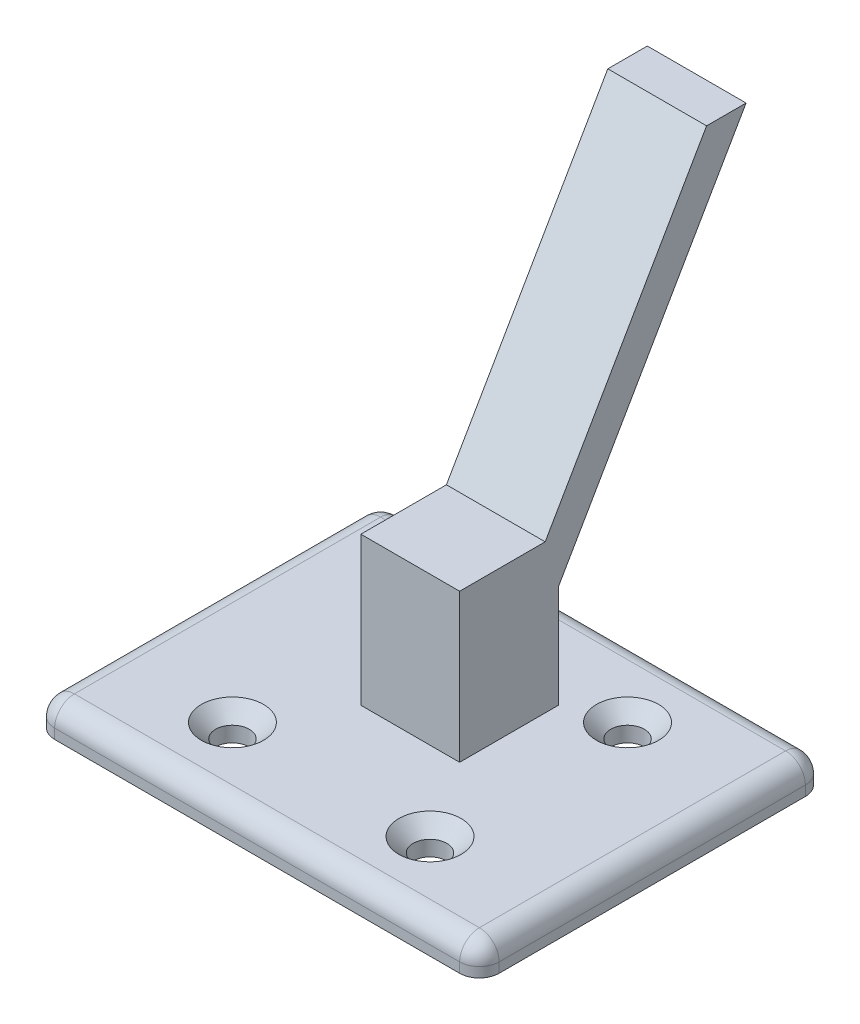
ISO-10303-21;
HEADER;
FILE_DESCRIPTION(('STEP AP214'),'2;1');
FILE_NAME('part.step','',(''),(''),'','','');
FILE_SCHEMA(('AUTOMOTIVE_DESIGN { 1 0 10303 214 1 1 1 1 }'));
ENDSEC;
DATA;
#1=APPLICATION_CONTEXT('core data for automotive mechanical design processes');
#2=APPLICATION_PROTOCOL_DEFINITION('international standard','automotive_design',2000,#1);
#3=PRODUCT_CONTEXT('',#1,'mechanical');
#4=PRODUCT('Part','Part','',(#3));
#5=PRODUCT_RELATED_PRODUCT_CATEGORY('part','',(#4));
#6=PRODUCT_DEFINITION_FORMATION('','',#4);
#7=PRODUCT_DEFINITION_CONTEXT('part definition',#1,'design');
#8=PRODUCT_DEFINITION('design','',#6,#7);
#9=PRODUCT_DEFINITION_SHAPE('','',#8);
#10=(LENGTH_UNIT() NAMED_UNIT(*) SI_UNIT(.MILLI.,.METRE.));
#11=(NAMED_UNIT(*) PLANE_ANGLE_UNIT() SI_UNIT($,.RADIAN.));
#12=(NAMED_UNIT(*) SI_UNIT($,.STERADIAN.) SOLID_ANGLE_UNIT());
#13=UNCERTAINTY_MEASURE_WITH_UNIT(LENGTH_MEASURE(1.E-05),#10,'distance_accuracy_value','');
#14=(GEOMETRIC_REPRESENTATION_CONTEXT(3) GLOBAL_UNCERTAINTY_ASSIGNED_CONTEXT((#13)) GLOBAL_UNIT_ASSIGNED_CONTEXT((#10,
#11,#12)) REPRESENTATION_CONTEXT('',''));
#15=CARTESIAN_POINT('',(0.,0.,0.));
#16=DIRECTION('',(0.,0.,1.));
#17=DIRECTION('',(1.,0.,0.));
#18=AXIS2_PLACEMENT_3D('',#15,#16,#17);
#19=CARTESIAN_POINT('',(0.,3.,0.));
#20=DIRECTION('',(0.,-1.,0.));
#21=DIRECTION('',(0.,0.,-1.));
#22=AXIS2_PLACEMENT_3D('',#19,#20,#21);
#23=PLANE('',#22);
#24=CARTESIAN_POINT('',(10.,3.,10.));
#25=DIRECTION('',(0.,1.,0.));
#26=DIRECTION('',(0.,0.,1.));
#27=AXIS2_PLACEMENT_3D('',#24,#25,#26);
#28=CIRCLE('',#27,3.15);
#29=CARTESIAN_POINT('',(10.,3.,13.15));
#30=VERTEX_POINT('',#29);
#31=EDGE_CURVE('E235',#30,#30,#28,.T.);
#32=ORIENTED_EDGE('',*,*,#31,.F.);
#33=EDGE_LOOP('',(#32));
#34=FACE_BOUND('',#33,.T.);
#35=CARTESIAN_POINT('',(-9.99999999999999,3.,10.));
#36=DIRECTION('',(0.,1.,0.));
#37=DIRECTION('',(0.,0.,1.));
#38=AXIS2_PLACEMENT_3D('',#35,#36,#37);
#39=CIRCLE('',#38,3.15);
#40=CARTESIAN_POINT('',(-9.99999999999999,3.,13.15));
#41=VERTEX_POINT('',#40);
#42=EDGE_CURVE('E226',#41,#41,#39,.T.);
#43=ORIENTED_EDGE('',*,*,#42,.F.);
#44=EDGE_LOOP('',(#43));
#45=FACE_BOUND('',#44,.T.);
#46=CARTESIAN_POINT('',(-10.,3.,-10.));
#47=DIRECTION('',(0.,1.,0.));
#48=DIRECTION('',(0.,0.,1.));
#49=AXIS2_PLACEMENT_3D('',#46,#47,#48);
#50=CIRCLE('',#49,3.15);
#51=CARTESIAN_POINT('',(-10.,3.,-6.85));
#52=VERTEX_POINT('',#51);
#53=EDGE_CURVE('E217',#52,#52,#50,.T.);
#54=ORIENTED_EDGE('',*,*,#53,.F.);
#55=EDGE_LOOP('',(#54));
#56=FACE_BOUND('',#55,.T.);
#57=CARTESIAN_POINT('',(9.99999999999998,3.,-10.));
#58=DIRECTION('',(0.,1.,0.));
#59=DIRECTION('',(0.,0.,1.));
#60=AXIS2_PLACEMENT_3D('',#57,#58,#59);
#61=CIRCLE('',#60,3.15);
#62=CARTESIAN_POINT('',(9.99999999999998,3.,-6.85000000000002));
#63=VERTEX_POINT('',#62);
#64=EDGE_CURVE('E208',#63,#63,#61,.T.);
#65=ORIENTED_EDGE('',*,*,#64,.F.);
#66=EDGE_LOOP('',(#65));
#67=FACE_BOUND('',#66,.T.);
#68=DIRECTION('',(-1.,0.,0.));
#69=VECTOR('',#68,1.);
#70=CARTESIAN_POINT('',(0.,3.,-15.5));
#71=LINE('',#70,#69);
#72=CARTESIAN_POINT('',(20.5,3.,-15.5));
#73=VERTEX_POINT('',#72);
#74=CARTESIAN_POINT('',(-20.5,3.,-15.5));
#75=VERTEX_POINT('',#74);
#76=EDGE_CURVE('E293',#73,#75,#71,.T.);
#77=ORIENTED_EDGE('',*,*,#76,.T.);
#78=DIRECTION('',(0.,0.,1.));
#79=VECTOR('',#78,1.);
#80=CARTESIAN_POINT('',(-20.5,3.,0.));
#81=LINE('',#80,#79);
#82=CARTESIAN_POINT('',(-20.5,3.,15.5));
#83=VERTEX_POINT('',#82);
#84=EDGE_CURVE('E43',#75,#83,#81,.T.);
#85=ORIENTED_EDGE('',*,*,#84,.T.);
#86=DIRECTION('',(1.,0.,0.));
#87=VECTOR('',#86,1.);
#88=CARTESIAN_POINT('',(0.,3.,15.5));
#89=LINE('',#88,#87);
#90=CARTESIAN_POINT('',(20.5,3.,15.5));
#91=VERTEX_POINT('',#90);
#92=EDGE_CURVE('E289',#83,#91,#89,.T.);
#93=ORIENTED_EDGE('',*,*,#92,.T.);
#94=DIRECTION('',(0.,0.,-1.));
#95=VECTOR('',#94,1.);
#96=CARTESIAN_POINT('',(20.5,3.,0.));
#97=LINE('',#96,#95);
#98=EDGE_CURVE('E291',#91,#73,#97,.T.);
#99=ORIENTED_EDGE('',*,*,#98,.T.);
#100=EDGE_LOOP('',(#77,#85,#93,#99));
#101=FACE_BOUND('',#100,.T.);
#102=DIRECTION('',(0.,0.,1.));
#103=VECTOR('',#102,1.);
#104=CARTESIAN_POINT('',(-5.,3.,2.));
#105=LINE('',#104,#103);
#106=CARTESIAN_POINT('',(-5.,3.,-8.00000000000001));
#107=VERTEX_POINT('',#106);
#108=CARTESIAN_POINT('',(-5.,3.,2.));
#109=VERTEX_POINT('',#108);
#110=EDGE_CURVE('E50',#107,#109,#105,.T.);
#111=ORIENTED_EDGE('',*,*,#110,.F.);
#112=DIRECTION('',(-1.,0.,0.));
#113=VECTOR('',#112,1.);
#114=CARTESIAN_POINT('',(-5.,3.,-8.00000000000001));
#115=LINE('',#114,#113);
#116=CARTESIAN_POINT('',(5.,3.,-8.00000000000001));
#117=VERTEX_POINT('',#116);
#118=EDGE_CURVE('E163',#117,#107,#115,.T.);
#119=ORIENTED_EDGE('',*,*,#118,.F.);
#120=DIRECTION('',(0.,0.,-1.));
#121=VECTOR('',#120,1.);
#122=CARTESIAN_POINT('',(5.,3.,2.));
#123=LINE('',#122,#121);
#124=CARTESIAN_POINT('',(5.,3.,1.99999999999999));
#125=VERTEX_POINT('',#124);
#126=EDGE_CURVE('E58',#125,#117,#123,.T.);
#127=ORIENTED_EDGE('',*,*,#126,.F.);
#128=DIRECTION('',(1.,0.,0.));
#129=VECTOR('',#128,1.);
#130=CARTESIAN_POINT('',(-5.,3.,2.));
#131=LINE('',#130,#129);
#132=EDGE_CURVE('E189',#109,#125,#131,.T.);
#133=ORIENTED_EDGE('',*,*,#132,.F.);
#134=EDGE_LOOP('',(#111,#119,#127,#133));
#135=FACE_BOUND('',#134,.T.);
#136=ADVANCED_FACE('F35',(#34,#45,#56,#67,#101,#135),#23,.F.);
#137=CARTESIAN_POINT('',(-5.,46.3012701892218,-27.0000000000002));
#138=DIRECTION('',(0.,0.500000000000004,0.866025403784436));
#139=DIRECTION('',(0.,-0.866025403784436,0.500000000000004));
#140=AXIS2_PLACEMENT_3D('',#137,#138,#139);
#141=PLANE('',#140);
#142=DIRECTION('',(1.,0.,0.));
#143=VECTOR('',#142,1.);
#144=CARTESIAN_POINT('',(-4.99999999999999,13.3923048454132,-8.00000000000001));
#145=LINE('',#144,#143);
#146=CARTESIAN_POINT('',(-5.,13.3923048454132,-8.));
#147=VERTEX_POINT('',#146);
#148=CARTESIAN_POINT('',(5.,13.3923048454132,-8.00000000000001));
#149=VERTEX_POINT('',#148);
#150=EDGE_CURVE('E176',#147,#149,#145,.T.);
#151=ORIENTED_EDGE('',*,*,#150,.F.);
#152=DIRECTION('',(0.,-0.866025403784436,0.500000000000004));
#153=VECTOR('',#152,1.);
#154=CARTESIAN_POINT('',(-5.,46.3012701892218,-27.0000000000002));
#155=LINE('',#154,#153);
#156=CARTESIAN_POINT('',(-5.,46.3012701892218,-27.0000000000002));
#157=VERTEX_POINT('',#156);
#158=EDGE_CURVE('E204',#157,#147,#155,.T.);
#159=ORIENTED_EDGE('',*,*,#158,.F.);
#160=DIRECTION('',(-1.,0.,0.));
#161=VECTOR('',#160,1.);
#162=CARTESIAN_POINT('',(-5.,46.3012701892218,-27.0000000000002));
#163=LINE('',#162,#161);
#164=CARTESIAN_POINT('',(5.,46.3012701892218,-27.0000000000002));
#165=VERTEX_POINT('',#164);
#166=EDGE_CURVE('E188',#165,#157,#163,.T.);
#167=ORIENTED_EDGE('',*,*,#166,.F.);
#168=DIRECTION('',(0.,-0.866025403784436,0.500000000000004));
#169=VECTOR('',#168,1.);
#170=CARTESIAN_POINT('',(5.,46.3012701892218,-27.0000000000002));
#171=LINE('',#170,#169);
#172=EDGE_CURVE('E206',#165,#149,#171,.T.);
#173=ORIENTED_EDGE('',*,*,#172,.T.);
#174=EDGE_LOOP('',(#151,#159,#167,#173));
#175=FACE_BOUND('',#174,.T.);
#176=ADVANCED_FACE('F402',(#175),#141,.F.);
#177=CARTESIAN_POINT('',(-5.,46.3012701892218,-23.0000000000002));
#178=DIRECTION('',(0.,-0.500000000000004,-0.866025403784436));
#179=DIRECTION('',(0.,0.866025403784436,-0.500000000000004));
#180=AXIS2_PLACEMENT_3D('',#177,#178,#179);
#181=PLANE('',#180);
#182=DIRECTION('',(-1.,0.,0.));
#183=VECTOR('',#182,1.);
#184=CARTESIAN_POINT('',(-5.,18.,-6.66025403784447));
#185=LINE('',#184,#183);
#186=CARTESIAN_POINT('',(5.,18.,-6.66025403784448));
#187=VERTEX_POINT('',#186);
#188=CARTESIAN_POINT('',(-5.,18.,-6.66025403784448));
#189=VERTEX_POINT('',#188);
#190=EDGE_CURVE('E11',#187,#189,#185,.T.);
#191=ORIENTED_EDGE('',*,*,#190,.F.);
#192=DIRECTION('',(0.,-0.866025403784436,0.500000000000004));
#193=VECTOR('',#192,1.);
#194=CARTESIAN_POINT('',(5.,46.3012701892218,-23.0000000000002));
#195=LINE('',#194,#193);
#196=CARTESIAN_POINT('',(5.,46.3012701892218,-23.0000000000002));
#197=VERTEX_POINT('',#196);
#198=EDGE_CURVE('E195',#197,#187,#195,.T.);
#199=ORIENTED_EDGE('',*,*,#198,.F.);
#200=DIRECTION('',(1.,0.,0.));
#201=VECTOR('',#200,1.);
#202=CARTESIAN_POINT('',(-5.,46.3012701892218,-23.0000000000002));
#203=LINE('',#202,#201);
#204=CARTESIAN_POINT('',(-5.,46.3012701892218,-23.0000000000002));
#205=VERTEX_POINT('',#204);
#206=EDGE_CURVE('E193',#205,#197,#203,.T.);
#207=ORIENTED_EDGE('',*,*,#206,.F.);
#208=DIRECTION('',(0.,-0.866025403784436,0.500000000000004));
#209=VECTOR('',#208,1.);
#210=CARTESIAN_POINT('',(-5.,46.3012701892218,-23.0000000000002));
#211=LINE('',#210,#209);
#212=EDGE_CURVE('E202',#205,#189,#211,.T.);
#213=ORIENTED_EDGE('',*,*,#212,.T.);
#214=EDGE_LOOP('',(#191,#199,#207,#213));
#215=FACE_BOUND('',#214,.T.);
#216=ADVANCED_FACE('F408',(#215),#181,.F.);
#217=CARTESIAN_POINT('',(-22.5,3.,-17.5));
#218=DIRECTION('',(1.,0.,0.));
#219=DIRECTION('',(0.,0.,-1.));
#220=AXIS2_PLACEMENT_3D('',#217,#218,#219);
#221=PLANE('',#220);
#222=DIRECTION('',(0.,0.,1.));
#223=VECTOR('',#222,1.);
#224=CARTESIAN_POINT('',(-22.5,1.,-17.5));
#225=LINE('',#224,#223);
#226=CARTESIAN_POINT('',(-22.5,1.,15.5));
#227=VERTEX_POINT('',#226);
#228=CARTESIAN_POINT('',(-22.5,1.,-15.5));
#229=VERTEX_POINT('',#228);
#230=EDGE_CURVE('E256',#227,#229,#225,.F.);
#231=ORIENTED_EDGE('',*,*,#230,.T.);
#232=DIRECTION('',(0.,-1.,0.));
#233=VECTOR('',#232,1.);
#234=CARTESIAN_POINT('',(-22.5,3.,-15.5));
#235=LINE('',#234,#233);
#236=CARTESIAN_POINT('',(-22.5,0.,-15.5));
#237=VERTEX_POINT('',#236);
#238=EDGE_CURVE('E260',#229,#237,#235,.T.);
#239=ORIENTED_EDGE('',*,*,#238,.T.);
#240=DIRECTION('',(0.,0.,1.));
#241=VECTOR('',#240,1.);
#242=CARTESIAN_POINT('',(-22.5,0.,-17.5));
#243=LINE('',#242,#241);
#244=CARTESIAN_POINT('',(-22.5,0.,15.5));
#245=VERTEX_POINT('',#244);
#246=EDGE_CURVE('E244',#237,#245,#243,.T.);
#247=ORIENTED_EDGE('',*,*,#246,.T.);
#248=DIRECTION('',(0.,-1.,0.));
#249=VECTOR('',#248,1.);
#250=CARTESIAN_POINT('',(-22.5,3.,15.5));
#251=LINE('',#250,#249);
#252=EDGE_CURVE('E258',#245,#227,#251,.F.);
#253=ORIENTED_EDGE('',*,*,#252,.T.);
#254=EDGE_LOOP('',(#231,#239,#247,#253));
#255=FACE_BOUND('',#254,.T.);
#256=ADVANCED_FACE('F365',(#255),#221,.F.);
#257=CARTESIAN_POINT('',(22.5,3.,17.5));
#258=DIRECTION('',(0.,0.,-1.));
#259=DIRECTION('',(-1.,0.,0.));
#260=AXIS2_PLACEMENT_3D('',#257,#258,#259);
#261=PLANE('',#260);
#262=DIRECTION('',(1.,0.,0.));
#263=VECTOR('',#262,1.);
#264=CARTESIAN_POINT('',(22.5,1.,17.5));
#265=LINE('',#264,#263);
#266=CARTESIAN_POINT('',(20.5,1.,17.5));
#267=VERTEX_POINT('',#266);
#268=CARTESIAN_POINT('',(-20.5,1.,17.5));
#269=VERTEX_POINT('',#268);
#270=EDGE_CURVE('E283',#267,#269,#265,.F.);
#271=ORIENTED_EDGE('',*,*,#270,.T.);
#272=DIRECTION('',(0.,-1.,0.));
#273=VECTOR('',#272,1.);
#274=CARTESIAN_POINT('',(-20.5,3.,17.5));
#275=LINE('',#274,#273);
#276=CARTESIAN_POINT('',(-20.5,0.,17.5));
#277=VERTEX_POINT('',#276);
#278=EDGE_CURVE('E287',#269,#277,#275,.T.);
#279=ORIENTED_EDGE('',*,*,#278,.T.);
#280=DIRECTION('',(1.,0.,0.));
#281=VECTOR('',#280,1.);
#282=CARTESIAN_POINT('',(22.5,0.,17.5));
#283=LINE('',#282,#281);
#284=CARTESIAN_POINT('',(20.5,0.,17.5));
#285=VERTEX_POINT('',#284);
#286=EDGE_CURVE('E247',#277,#285,#283,.T.);
#287=ORIENTED_EDGE('',*,*,#286,.T.);
#288=DIRECTION('',(0.,-1.,0.));
#289=VECTOR('',#288,1.);
#290=CARTESIAN_POINT('',(20.5,3.,17.5));
#291=LINE('',#290,#289);
#292=EDGE_CURVE('E285',#285,#267,#291,.F.);
#293=ORIENTED_EDGE('',*,*,#292,.T.);
#294=EDGE_LOOP('',(#271,#279,#287,#293));
#295=FACE_BOUND('',#294,.T.);
#296=ADVANCED_FACE('F353',(#295),#261,.F.);
#297=CARTESIAN_POINT('',(22.5,3.,-17.5));
#298=DIRECTION('',(-1.,0.,0.));
#299=DIRECTION('',(0.,0.,1.));
#300=AXIS2_PLACEMENT_3D('',#297,#298,#299);
#301=PLANE('',#300);
#302=DIRECTION('',(0.,0.,-1.));
#303=VECTOR('',#302,1.);
#304=CARTESIAN_POINT('',(22.5,0.,-17.5));
#305=LINE('',#304,#303);
#306=CARTESIAN_POINT('',(22.5,0.,15.5));
#307=VERTEX_POINT('',#306);
#308=CARTESIAN_POINT('',(22.5,0.,-15.5));
#309=VERTEX_POINT('',#308);
#310=EDGE_CURVE('E250',#307,#309,#305,.T.);
#311=ORIENTED_EDGE('',*,*,#310,.T.);
#312=DIRECTION('',(0.,-1.,0.));
#313=VECTOR('',#312,1.);
#314=CARTESIAN_POINT('',(22.5,3.,-15.5));
#315=LINE('',#314,#313);
#316=CARTESIAN_POINT('',(22.5,1.,-15.5));
#317=VERTEX_POINT('',#316);
#318=EDGE_CURVE('E281',#309,#317,#315,.F.);
#319=ORIENTED_EDGE('',*,*,#318,.T.);
#320=DIRECTION('',(0.,0.,-1.));
#321=VECTOR('',#320,1.);
#322=CARTESIAN_POINT('',(22.5,1.,-17.5));
#323=LINE('',#322,#321);
#324=CARTESIAN_POINT('',(22.5,1.,15.5));
#325=VERTEX_POINT('',#324);
#326=EDGE_CURVE('E277',#317,#325,#323,.F.);
#327=ORIENTED_EDGE('',*,*,#326,.T.);
#328=DIRECTION('',(0.,-1.,0.));
#329=VECTOR('',#328,1.);
#330=CARTESIAN_POINT('',(22.5,3.,15.5));
#331=LINE('',#330,#329);
#332=EDGE_CURVE('E279',#325,#307,#331,.T.);
#333=ORIENTED_EDGE('',*,*,#332,.T.);
#334=EDGE_LOOP('',(#311,#319,#327,#333));
#335=FACE_BOUND('',#334,.T.);
#336=ADVANCED_FACE('F422',(#335),#301,.F.);
#337=CARTESIAN_POINT('',(22.5,3.,-17.5));
#338=DIRECTION('',(0.,0.,1.));
#339=DIRECTION('',(1.,0.,0.));
#340=AXIS2_PLACEMENT_3D('',#337,#338,#339);
#341=PLANE('',#340);
#342=DIRECTION('',(-1.,0.,0.));
#343=VECTOR('',#342,1.);
#344=CARTESIAN_POINT('',(22.5,0.,-17.5));
#345=LINE('',#344,#343);
#346=CARTESIAN_POINT('',(20.5,0.,-17.5));
#347=VERTEX_POINT('',#346);
#348=CARTESIAN_POINT('',(-20.5,0.,-17.5));
#349=VERTEX_POINT('',#348);
#350=EDGE_CURVE('E253',#347,#349,#345,.T.);
#351=ORIENTED_EDGE('',*,*,#350,.T.);
#352=DIRECTION('',(0.,-1.,0.));
#353=VECTOR('',#352,1.);
#354=CARTESIAN_POINT('',(-20.5,3.,-17.5));
#355=LINE('',#354,#353);
#356=CARTESIAN_POINT('',(-20.5,1.,-17.5));
#357=VERTEX_POINT('',#356);
#358=EDGE_CURVE('E275',#349,#357,#355,.F.);
#359=ORIENTED_EDGE('',*,*,#358,.T.);
#360=DIRECTION('',(-1.,0.,0.));
#361=VECTOR('',#360,1.);
#362=CARTESIAN_POINT('',(22.5,1.,-17.5));
#363=LINE('',#362,#361);
#364=CARTESIAN_POINT('',(20.5,1.,-17.5));
#365=VERTEX_POINT('',#364);
#366=EDGE_CURVE('E271',#357,#365,#363,.F.);
#367=ORIENTED_EDGE('',*,*,#366,.T.);
#368=DIRECTION('',(0.,-1.,0.));
#369=VECTOR('',#368,1.);
#370=CARTESIAN_POINT('',(20.5,3.,-17.5));
#371=LINE('',#370,#369);
#372=EDGE_CURVE('E273',#365,#347,#371,.T.);
#373=ORIENTED_EDGE('',*,*,#372,.T.);
#374=EDGE_LOOP('',(#351,#359,#367,#373));
#375=FACE_BOUND('',#374,.T.);
#376=ADVANCED_FACE('F376',(#375),#341,.F.);
#377=CARTESIAN_POINT('',(0.,0.,0.));
#378=DIRECTION('',(0.,-1.,0.));
#379=DIRECTION('',(0.,0.,-1.));
#380=AXIS2_PLACEMENT_3D('',#377,#378,#379);
#381=PLANE('',#380);
#382=CARTESIAN_POINT('',(9.99999999999998,0.,-10.));
#383=DIRECTION('',(0.,-1.,0.));
#384=DIRECTION('',(0.,0.,-1.));
#385=AXIS2_PLACEMENT_3D('',#382,#383,#384);
#386=CIRCLE('',#385,1.69999999999999);
#387=CARTESIAN_POINT('',(9.99999999999998,0.,-11.7));
#388=VERTEX_POINT('',#387);
#389=EDGE_CURVE('E214',#388,#388,#386,.T.);
#390=ORIENTED_EDGE('',*,*,#389,.F.);
#391=EDGE_LOOP('',(#390));
#392=FACE_BOUND('',#391,.T.);
#393=CARTESIAN_POINT('',(-10.,0.,-10.));
#394=DIRECTION('',(0.,-1.,0.));
#395=DIRECTION('',(0.,0.,-1.));
#396=AXIS2_PLACEMENT_3D('',#393,#394,#395);
#397=CIRCLE('',#396,1.69999999999999);
#398=CARTESIAN_POINT('',(-10.,0.,-11.7));
#399=VERTEX_POINT('',#398);
#400=EDGE_CURVE('E223',#399,#399,#397,.T.);
#401=ORIENTED_EDGE('',*,*,#400,.F.);
#402=EDGE_LOOP('',(#401));
#403=FACE_BOUND('',#402,.T.);
#404=CARTESIAN_POINT('',(-9.99999999999999,0.,10.));
#405=DIRECTION('',(0.,-1.,0.));
#406=DIRECTION('',(0.,0.,-1.));
#407=AXIS2_PLACEMENT_3D('',#404,#405,#406);
#408=CIRCLE('',#407,1.69999999999999);
#409=CARTESIAN_POINT('',(-9.99999999999999,0.,8.30000000000001));
#410=VERTEX_POINT('',#409);
#411=EDGE_CURVE('E232',#410,#410,#408,.T.);
#412=ORIENTED_EDGE('',*,*,#411,.F.);
#413=EDGE_LOOP('',(#412));
#414=FACE_BOUND('',#413,.T.);
#415=CARTESIAN_POINT('',(10.,0.,10.));
#416=DIRECTION('',(0.,-1.,0.));
#417=DIRECTION('',(0.,0.,-1.));
#418=AXIS2_PLACEMENT_3D('',#415,#416,#417);
#419=CIRCLE('',#418,1.69999999999999);
#420=CARTESIAN_POINT('',(10.,0.,8.30000000000002));
#421=VERTEX_POINT('',#420);
#422=EDGE_CURVE('E241',#421,#421,#419,.T.);
#423=ORIENTED_EDGE('',*,*,#422,.F.);
#424=EDGE_LOOP('',(#423));
#425=FACE_BOUND('',#424,.T.);
#426=ORIENTED_EDGE('',*,*,#246,.F.);
#427=CARTESIAN_POINT('',(-20.5,0.,-15.5));
#428=DIRECTION('',(0.,-1.,0.));
#429=DIRECTION('',(0.,0.,-1.));
#430=AXIS2_PLACEMENT_3D('',#427,#428,#429);
#431=CIRCLE('',#430,2.);
#432=EDGE_CURVE('E269',#237,#349,#431,.T.);
#433=ORIENTED_EDGE('',*,*,#432,.T.);
#434=ORIENTED_EDGE('',*,*,#350,.F.);
#435=CARTESIAN_POINT('',(20.5,0.,-15.5));
#436=DIRECTION('',(0.,-1.,0.));
#437=DIRECTION('',(0.,0.,-1.));
#438=AXIS2_PLACEMENT_3D('',#435,#436,#437);
#439=CIRCLE('',#438,2.);
#440=EDGE_CURVE('E267',#347,#309,#439,.T.);
#441=ORIENTED_EDGE('',*,*,#440,.T.);
#442=ORIENTED_EDGE('',*,*,#310,.F.);
#443=CARTESIAN_POINT('',(20.5,0.,15.5));
#444=DIRECTION('',(0.,-1.,0.));
#445=DIRECTION('',(0.,0.,-1.));
#446=AXIS2_PLACEMENT_3D('',#443,#444,#445);
#447=CIRCLE('',#446,2.);
#448=EDGE_CURVE('E263',#307,#285,#447,.T.);
#449=ORIENTED_EDGE('',*,*,#448,.T.);
#450=ORIENTED_EDGE('',*,*,#286,.F.);
#451=CARTESIAN_POINT('',(-20.5,0.,15.5));
#452=DIRECTION('',(0.,-1.,0.));
#453=DIRECTION('',(0.,0.,-1.));
#454=AXIS2_PLACEMENT_3D('',#451,#452,#453);
#455=CIRCLE('',#454,2.);
#456=EDGE_CURVE('E265',#277,#245,#455,.T.);
#457=ORIENTED_EDGE('',*,*,#456,.T.);
#458=EDGE_LOOP('',(#426,#433,#434,#441,#442,#449,#450,#457));
#459=FACE_BOUND('',#458,.T.);
#460=ADVANCED_FACE('F363',(#392,#403,#414,#425,#459),#381,.T.);
#461=CARTESIAN_POINT('',(10.,3.,10.));
#462=DIRECTION('',(0.,1.,0.));
#463=DIRECTION('',(0.,0.,1.));
#464=AXIS2_PLACEMENT_3D('',#461,#462,#463);
#465=CYLINDRICAL_SURFACE('',#464,1.69999999999999);
#466=CARTESIAN_POINT('',(10.,1.54999999999999,10.));
#467=DIRECTION('',(0.,1.,0.));
#468=DIRECTION('',(0.,0.,1.));
#469=AXIS2_PLACEMENT_3D('',#466,#467,#468);
#470=CIRCLE('',#469,1.69999999999999);
#471=CARTESIAN_POINT('',(10.,1.54999999999999,11.7));
#472=VERTEX_POINT('',#471);
#473=EDGE_CURVE('E238',#472,#472,#470,.T.);
#474=ORIENTED_EDGE('',*,*,#473,.T.);
#475=EDGE_LOOP('',(#474));
#476=FACE_BOUND('',#475,.T.);
#477=ORIENTED_EDGE('',*,*,#422,.T.);
#478=EDGE_LOOP('',(#477));
#479=FACE_BOUND('',#478,.T.);
#480=ADVANCED_FACE('F415',(#476,#479),#465,.F.);
#481=CARTESIAN_POINT('',(10.,3.,10.));
#482=DIRECTION('',(0.,1.,0.));
#483=DIRECTION('',(0.,0.,1.));
#484=AXIS2_PLACEMENT_3D('',#481,#482,#483);
#485=CONICAL_SURFACE('',#484,3.15,0.78539816339745);
#486=ORIENTED_EDGE('',*,*,#473,.F.);
#487=EDGE_LOOP('',(#486));
#488=FACE_BOUND('',#487,.T.);
#489=ORIENTED_EDGE('',*,*,#31,.T.);
#490=EDGE_LOOP('',(#489));
#491=FACE_BOUND('',#490,.T.);
#492=ADVANCED_FACE('F623',(#488,#491),#485,.F.);
#493=CARTESIAN_POINT('',(-9.99999999999999,3.,10.));
#494=DIRECTION('',(0.,1.,0.));
#495=DIRECTION('',(0.,0.,1.));
#496=AXIS2_PLACEMENT_3D('',#493,#494,#495);
#497=CYLINDRICAL_SURFACE('',#496,1.69999999999999);
#498=CARTESIAN_POINT('',(-9.99999999999999,1.54999999999999,10.));
#499=DIRECTION('',(0.,1.,0.));
#500=DIRECTION('',(0.,0.,1.));
#501=AXIS2_PLACEMENT_3D('',#498,#499,#500);
#502=CIRCLE('',#501,1.69999999999999);
#503=CARTESIAN_POINT('',(-9.99999999999999,1.54999999999999,11.7));
#504=VERTEX_POINT('',#503);
#505=EDGE_CURVE('E229',#504,#504,#502,.T.);
#506=ORIENTED_EDGE('',*,*,#505,.T.);
#507=EDGE_LOOP('',(#506));
#508=FACE_BOUND('',#507,.T.);
#509=ORIENTED_EDGE('',*,*,#411,.T.);
#510=EDGE_LOOP('',(#509));
#511=FACE_BOUND('',#510,.T.);
#512=ADVANCED_FACE('F629',(#508,#511),#497,.F.);
#513=CARTESIAN_POINT('',(-9.99999999999999,3.,10.));
#514=DIRECTION('',(0.,1.,0.));
#515=DIRECTION('',(0.,0.,1.));
#516=AXIS2_PLACEMENT_3D('',#513,#514,#515);
#517=CONICAL_SURFACE('',#516,3.15,0.78539816339745);
#518=ORIENTED_EDGE('',*,*,#505,.F.);
#519=EDGE_LOOP('',(#518));
#520=FACE_BOUND('',#519,.T.);
#521=ORIENTED_EDGE('',*,*,#42,.T.);
#522=EDGE_LOOP('',(#521));
#523=FACE_BOUND('',#522,.T.);
#524=ADVANCED_FACE('F636',(#520,#523),#517,.F.);
#525=CARTESIAN_POINT('',(-10.,3.,-10.));
#526=DIRECTION('',(0.,1.,0.));
#527=DIRECTION('',(0.,0.,1.));
#528=AXIS2_PLACEMENT_3D('',#525,#526,#527);
#529=CYLINDRICAL_SURFACE('',#528,1.69999999999999);
#530=CARTESIAN_POINT('',(-10.,1.54999999999999,-10.));
#531=DIRECTION('',(0.,1.,0.));
#532=DIRECTION('',(0.,0.,1.));
#533=AXIS2_PLACEMENT_3D('',#530,#531,#532);
#534=CIRCLE('',#533,1.69999999999999);
#535=CARTESIAN_POINT('',(-10.,1.54999999999999,-8.30000000000001));
#536=VERTEX_POINT('',#535);
#537=EDGE_CURVE('E220',#536,#536,#534,.T.);
#538=ORIENTED_EDGE('',*,*,#537,.T.);
#539=EDGE_LOOP('',(#538));
#540=FACE_BOUND('',#539,.T.);
#541=ORIENTED_EDGE('',*,*,#400,.T.);
#542=EDGE_LOOP('',(#541));
#543=FACE_BOUND('',#542,.T.);
#544=ADVANCED_FACE('F644',(#540,#543),#529,.F.);
#545=CARTESIAN_POINT('',(-10.,3.,-10.));
#546=DIRECTION('',(0.,1.,0.));
#547=DIRECTION('',(0.,0.,1.));
#548=AXIS2_PLACEMENT_3D('',#545,#546,#547);
#549=CONICAL_SURFACE('',#548,3.15,0.78539816339745);
#550=ORIENTED_EDGE('',*,*,#537,.F.);
#551=EDGE_LOOP('',(#550));
#552=FACE_BOUND('',#551,.T.);
#553=ORIENTED_EDGE('',*,*,#53,.T.);
#554=EDGE_LOOP('',(#553));
#555=FACE_BOUND('',#554,.T.);
#556=ADVANCED_FACE('F652',(#552,#555),#549,.F.);
#557=CARTESIAN_POINT('',(9.99999999999998,3.,-10.));
#558=DIRECTION('',(0.,1.,0.));
#559=DIRECTION('',(0.,0.,1.));
#560=AXIS2_PLACEMENT_3D('',#557,#558,#559);
#561=CYLINDRICAL_SURFACE('',#560,1.69999999999999);
#562=CARTESIAN_POINT('',(9.99999999999998,1.54999999999999,-10.));
#563=DIRECTION('',(0.,1.,0.));
#564=DIRECTION('',(0.,0.,1.));
#565=AXIS2_PLACEMENT_3D('',#562,#563,#564);
#566=CIRCLE('',#565,1.69999999999999);
#567=CARTESIAN_POINT('',(9.99999999999998,1.54999999999999,-8.30000000000003));
#568=VERTEX_POINT('',#567);
#569=EDGE_CURVE('E211',#568,#568,#566,.T.);
#570=ORIENTED_EDGE('',*,*,#569,.T.);
#571=EDGE_LOOP('',(#570));
#572=FACE_BOUND('',#571,.T.);
#573=ORIENTED_EDGE('',*,*,#389,.T.);
#574=EDGE_LOOP('',(#573));
#575=FACE_BOUND('',#574,.T.);
#576=ADVANCED_FACE('F660',(#572,#575),#561,.F.);
#577=CARTESIAN_POINT('',(9.99999999999998,3.,-10.));
#578=DIRECTION('',(0.,1.,0.));
#579=DIRECTION('',(0.,0.,1.));
#580=AXIS2_PLACEMENT_3D('',#577,#578,#579);
#581=CONICAL_SURFACE('',#580,3.15,0.78539816339745);
#582=ORIENTED_EDGE('',*,*,#569,.F.);
#583=EDGE_LOOP('',(#582));
#584=FACE_BOUND('',#583,.T.);
#585=ORIENTED_EDGE('',*,*,#64,.T.);
#586=EDGE_LOOP('',(#585));
#587=FACE_BOUND('',#586,.T.);
#588=ADVANCED_FACE('F495',(#584,#587),#581,.F.);
#589=CARTESIAN_POINT('',(5.,46.3012701892218,-23.0000000000002));
#590=DIRECTION('',(-1.,0.,0.));
#591=DIRECTION('',(0.,0.,1.));
#592=AXIS2_PLACEMENT_3D('',#589,#590,#591);
#593=PLANE('',#592);
#594=ORIENTED_EDGE('',*,*,#126,.T.);
#595=DIRECTION('',(0.,-1.,0.));
#596=VECTOR('',#595,1.);
#597=CARTESIAN_POINT('',(5.,18.,-8.00000000000001));
#598=LINE('',#597,#596);
#599=EDGE_CURVE('E181',#149,#117,#598,.T.);
#600=ORIENTED_EDGE('',*,*,#599,.F.);
#601=ORIENTED_EDGE('',*,*,#172,.F.);
#602=DIRECTION('',(0.,0.,-1.));
#603=VECTOR('',#602,1.);
#604=CARTESIAN_POINT('',(5.,46.3012701892218,-23.0000000000002));
#605=LINE('',#604,#603);
#606=EDGE_CURVE('E185',#197,#165,#605,.T.);
#607=ORIENTED_EDGE('',*,*,#606,.F.);
#608=ORIENTED_EDGE('',*,*,#198,.T.);
#609=DIRECTION('',(0.,0.,-1.));
#610=VECTOR('',#609,1.);
#611=CARTESIAN_POINT('',(5.,18.,1.99999999999999));
#612=LINE('',#611,#610);
#613=CARTESIAN_POINT('',(5.,18.,1.99999999999999));
#614=VERTEX_POINT('',#613);
#615=EDGE_CURVE('E172',#614,#187,#612,.T.);
#616=ORIENTED_EDGE('',*,*,#615,.F.);
#617=DIRECTION('',(0.,-1.,0.));
#618=VECTOR('',#617,1.);
#619=CARTESIAN_POINT('',(5.,18.,1.99999999999999));
#620=LINE('',#619,#618);
#621=EDGE_CURVE('E170',#614,#125,#620,.T.);
#622=ORIENTED_EDGE('',*,*,#621,.T.);
#623=EDGE_LOOP('',(#594,#600,#601,#607,#608,#616,#622));
#624=FACE_BOUND('',#623,.T.);
#625=ADVANCED_FACE('F483',(#624),#593,.F.);
#626=CARTESIAN_POINT('',(-5.,46.3012701892218,-23.0000000000002));
#627=DIRECTION('',(1.,0.,0.));
#628=DIRECTION('',(0.,0.,-1.));
#629=AXIS2_PLACEMENT_3D('',#626,#627,#628);
#630=PLANE('',#629);
#631=ORIENTED_EDGE('',*,*,#158,.T.);
#632=DIRECTION('',(0.,-1.,0.));
#633=VECTOR('',#632,1.);
#634=CARTESIAN_POINT('',(-5.,18.,-8.00000000000001));
#635=LINE('',#634,#633);
#636=EDGE_CURVE('E732',#147,#107,#635,.T.);
#637=ORIENTED_EDGE('',*,*,#636,.T.);
#638=ORIENTED_EDGE('',*,*,#110,.T.);
#639=DIRECTION('',(0.,-1.,0.));
#640=VECTOR('',#639,1.);
#641=CARTESIAN_POINT('',(-5.,18.,1.99999999999999));
#642=LINE('',#641,#640);
#643=CARTESIAN_POINT('',(-5.,18.,1.99999999999999));
#644=VERTEX_POINT('',#643);
#645=EDGE_CURVE('E169',#644,#109,#642,.T.);
#646=ORIENTED_EDGE('',*,*,#645,.F.);
#647=DIRECTION('',(0.,0.,1.));
#648=VECTOR('',#647,1.);
#649=CARTESIAN_POINT('',(-5.,18.,1.99999999999999));
#650=LINE('',#649,#648);
#651=EDGE_CURVE('E154',#189,#644,#650,.T.);
#652=ORIENTED_EDGE('',*,*,#651,.F.);
#653=ORIENTED_EDGE('',*,*,#212,.F.);
#654=DIRECTION('',(0.,0.,1.));
#655=VECTOR('',#654,1.);
#656=CARTESIAN_POINT('',(-5.,46.3012701892218,-23.0000000000002));
#657=LINE('',#656,#655);
#658=EDGE_CURVE('E191',#157,#205,#657,.T.);
#659=ORIENTED_EDGE('',*,*,#658,.F.);
#660=EDGE_LOOP('',(#631,#637,#638,#646,#652,#653,#659));
#661=FACE_BOUND('',#660,.T.);
#662=ADVANCED_FACE('F175',(#661),#630,.F.);
#663=CARTESIAN_POINT('',(0.,46.3012701892218,-25.0000000000002));
#664=DIRECTION('',(0.,-1.,0.));
#665=DIRECTION('',(0.,0.,-1.));
#666=AXIS2_PLACEMENT_3D('',#663,#664,#665);
#667=PLANE('',#666);
#668=ORIENTED_EDGE('',*,*,#606,.T.);
#669=ORIENTED_EDGE('',*,*,#166,.T.);
#670=ORIENTED_EDGE('',*,*,#658,.T.);
#671=ORIENTED_EDGE('',*,*,#206,.T.);
#672=EDGE_LOOP('',(#668,#669,#670,#671));
#673=FACE_BOUND('',#672,.T.);
#674=ADVANCED_FACE('F482',(#673),#667,.F.);
#675=CARTESIAN_POINT('',(20.5,3.,15.5));
#676=DIRECTION('',(0.,-1.,0.));
#677=DIRECTION('',(0.,0.,-1.));
#678=AXIS2_PLACEMENT_3D('',#675,#676,#677);
#679=CYLINDRICAL_SURFACE('',#678,2.);
#680=CARTESIAN_POINT('',(20.5,1.,15.5));
#681=DIRECTION('',(0.,1.,0.));
#682=DIRECTION('',(0.,0.,1.));
#683=AXIS2_PLACEMENT_3D('',#680,#681,#682);
#684=CIRCLE('',#683,2.);
#685=EDGE_CURVE('E197',#267,#325,#684,.T.);
#686=ORIENTED_EDGE('',*,*,#685,.F.);
#687=ORIENTED_EDGE('',*,*,#292,.F.);
#688=ORIENTED_EDGE('',*,*,#448,.F.);
#689=ORIENTED_EDGE('',*,*,#332,.F.);
#690=EDGE_LOOP('',(#686,#687,#688,#689));
#691=FACE_BOUND('',#690,.T.);
#692=ADVANCED_FACE('F37',(#691),#679,.T.);
#693=CARTESIAN_POINT('',(20.5,1.,15.5));
#694=DIRECTION('',(0.,0.,1.));
#695=DIRECTION('',(1.,0.,0.));
#696=AXIS2_PLACEMENT_3D('',#693,#694,#695);
#697=SPHERICAL_SURFACE('',#696,2.);
#698=CARTESIAN_POINT('',(20.5,1.,15.5));
#699=DIRECTION('',(1.,0.,0.));
#700=DIRECTION('',(0.,0.,-1.));
#701=AXIS2_PLACEMENT_3D('',#698,#699,#700);
#702=CIRCLE('',#701,2.);
#703=EDGE_CURVE('E322',#267,#91,#702,.F.);
#704=ORIENTED_EDGE('',*,*,#703,.F.);
#705=ORIENTED_EDGE('',*,*,#685,.T.);
#706=CARTESIAN_POINT('',(20.5,1.,15.5));
#707=DIRECTION('',(0.,0.,1.));
#708=DIRECTION('',(0.,-1.,0.));
#709=AXIS2_PLACEMENT_3D('',#706,#707,#708);
#710=CIRCLE('',#709,2.);
#711=EDGE_CURVE('E325',#91,#325,#710,.F.);
#712=ORIENTED_EDGE('',*,*,#711,.F.);
#713=EDGE_LOOP('',(#704,#705,#712));
#714=FACE_BOUND('',#713,.T.);
#715=ADVANCED_FACE('F332',(#714),#697,.T.);
#716=CARTESIAN_POINT('',(20.5,3.,-15.5));
#717=DIRECTION('',(0.,-1.,0.));
#718=DIRECTION('',(0.,0.,-1.));
#719=AXIS2_PLACEMENT_3D('',#716,#717,#718);
#720=CYLINDRICAL_SURFACE('',#719,2.);
#721=ORIENTED_EDGE('',*,*,#440,.F.);
#722=ORIENTED_EDGE('',*,*,#372,.F.);
#723=CARTESIAN_POINT('',(20.5,1.,-15.5));
#724=DIRECTION('',(0.,1.,0.));
#725=DIRECTION('',(0.,0.,1.));
#726=AXIS2_PLACEMENT_3D('',#723,#724,#725);
#727=CIRCLE('',#726,2.);
#728=EDGE_CURVE('E319',#317,#365,#727,.T.);
#729=ORIENTED_EDGE('',*,*,#728,.F.);
#730=ORIENTED_EDGE('',*,*,#318,.F.);
#731=EDGE_LOOP('',(#721,#722,#729,#730));
#732=FACE_BOUND('',#731,.T.);
#733=ADVANCED_FACE('F380',(#732),#720,.T.);
#734=CARTESIAN_POINT('',(20.5,1.,0.));
#735=DIRECTION('',(0.,0.,-1.));
#736=DIRECTION('',(-1.,0.,0.));
#737=AXIS2_PLACEMENT_3D('',#734,#735,#736);
#738=CYLINDRICAL_SURFACE('',#737,2.);
#739=ORIENTED_EDGE('',*,*,#711,.T.);
#740=ORIENTED_EDGE('',*,*,#326,.F.);
#741=CARTESIAN_POINT('',(20.5,1.,-15.5));
#742=DIRECTION('',(0.,0.,-1.));
#743=DIRECTION('',(-1.,0.,0.));
#744=AXIS2_PLACEMENT_3D('',#741,#742,#743);
#745=CIRCLE('',#744,2.);
#746=EDGE_CURVE('E316',#73,#317,#745,.T.);
#747=ORIENTED_EDGE('',*,*,#746,.F.);
#748=ORIENTED_EDGE('',*,*,#98,.F.);
#749=EDGE_LOOP('',(#739,#740,#747,#748));
#750=FACE_BOUND('',#749,.T.);
#751=ADVANCED_FACE('F340',(#750),#738,.T.);
#752=CARTESIAN_POINT('',(0.,1.,15.5));
#753=DIRECTION('',(1.,0.,0.));
#754=DIRECTION('',(0.,0.,-1.));
#755=AXIS2_PLACEMENT_3D('',#752,#753,#754);
#756=CYLINDRICAL_SURFACE('',#755,2.);
#757=ORIENTED_EDGE('',*,*,#703,.T.);
#758=ORIENTED_EDGE('',*,*,#92,.F.);
#759=CARTESIAN_POINT('',(-20.5,1.,15.5));
#760=DIRECTION('',(-1.,0.,0.));
#761=DIRECTION('',(0.,-1.,0.));
#762=AXIS2_PLACEMENT_3D('',#759,#760,#761);
#763=CIRCLE('',#762,2.);
#764=EDGE_CURVE('E313',#269,#83,#763,.T.);
#765=ORIENTED_EDGE('',*,*,#764,.F.);
#766=ORIENTED_EDGE('',*,*,#270,.F.);
#767=EDGE_LOOP('',(#757,#758,#765,#766));
#768=FACE_BOUND('',#767,.T.);
#769=ADVANCED_FACE('F350',(#768),#756,.T.);
#770=CARTESIAN_POINT('',(-20.5,3.,15.5));
#771=DIRECTION('',(0.,-1.,0.));
#772=DIRECTION('',(0.,0.,-1.));
#773=AXIS2_PLACEMENT_3D('',#770,#771,#772);
#774=CYLINDRICAL_SURFACE('',#773,2.);
#775=ORIENTED_EDGE('',*,*,#456,.F.);
#776=ORIENTED_EDGE('',*,*,#278,.F.);
#777=CARTESIAN_POINT('',(-20.5,1.,15.5));
#778=DIRECTION('',(0.,1.,0.));
#779=DIRECTION('',(0.,0.,1.));
#780=AXIS2_PLACEMENT_3D('',#777,#778,#779);
#781=CIRCLE('',#780,2.);
#782=EDGE_CURVE('E310',#227,#269,#781,.T.);
#783=ORIENTED_EDGE('',*,*,#782,.F.);
#784=ORIENTED_EDGE('',*,*,#252,.F.);
#785=EDGE_LOOP('',(#775,#776,#783,#784));
#786=FACE_BOUND('',#785,.T.);
#787=ADVANCED_FACE('F358',(#786),#774,.T.);
#788=CARTESIAN_POINT('',(20.5,1.,-15.5));
#789=DIRECTION('',(0.,0.,1.));
#790=DIRECTION('',(1.,0.,0.));
#791=AXIS2_PLACEMENT_3D('',#788,#789,#790);
#792=SPHERICAL_SURFACE('',#791,2.);
#793=ORIENTED_EDGE('',*,*,#746,.T.);
#794=ORIENTED_EDGE('',*,*,#728,.T.);
#795=CARTESIAN_POINT('',(20.5,1.,-15.5));
#796=DIRECTION('',(1.,0.,0.));
#797=DIRECTION('',(0.,0.,-1.));
#798=AXIS2_PLACEMENT_3D('',#795,#796,#797);
#799=CIRCLE('',#798,2.);
#800=EDGE_CURVE('E307',#73,#365,#799,.F.);
#801=ORIENTED_EDGE('',*,*,#800,.F.);
#802=EDGE_LOOP('',(#793,#794,#801));
#803=FACE_BOUND('',#802,.T.);
#804=ADVANCED_FACE('F383',(#803),#792,.T.);
#805=CARTESIAN_POINT('',(-20.5,1.,15.5));
#806=DIRECTION('',(0.,0.,1.));
#807=DIRECTION('',(1.,0.,0.));
#808=AXIS2_PLACEMENT_3D('',#805,#806,#807);
#809=SPHERICAL_SURFACE('',#808,2.);
#810=ORIENTED_EDGE('',*,*,#782,.T.);
#811=ORIENTED_EDGE('',*,*,#764,.T.);
#812=CARTESIAN_POINT('',(-20.5,1.,15.5));
#813=DIRECTION('',(0.,0.,1.));
#814=DIRECTION('',(1.,0.,0.));
#815=AXIS2_PLACEMENT_3D('',#812,#813,#814);
#816=CIRCLE('',#815,2.);
#817=EDGE_CURVE('E305',#227,#83,#816,.F.);
#818=ORIENTED_EDGE('',*,*,#817,.F.);
#819=EDGE_LOOP('',(#810,#811,#818));
#820=FACE_BOUND('',#819,.T.);
#821=ADVANCED_FACE('F392',(#820),#809,.T.);
#822=CARTESIAN_POINT('',(0.,1.,-15.5));
#823=DIRECTION('',(-1.,0.,0.));
#824=DIRECTION('',(0.,0.,1.));
#825=AXIS2_PLACEMENT_3D('',#822,#823,#824);
#826=CYLINDRICAL_SURFACE('',#825,2.);
#827=ORIENTED_EDGE('',*,*,#800,.T.);
#828=ORIENTED_EDGE('',*,*,#366,.F.);
#829=CARTESIAN_POINT('',(-20.5,1.,-15.5));
#830=DIRECTION('',(-1.,0.,0.));
#831=DIRECTION('',(0.,0.,1.));
#832=AXIS2_PLACEMENT_3D('',#829,#830,#831);
#833=CIRCLE('',#832,2.);
#834=EDGE_CURVE('E302',#75,#357,#833,.T.);
#835=ORIENTED_EDGE('',*,*,#834,.F.);
#836=ORIENTED_EDGE('',*,*,#76,.F.);
#837=EDGE_LOOP('',(#827,#828,#835,#836));
#838=FACE_BOUND('',#837,.T.);
#839=ADVANCED_FACE('F385',(#838),#826,.T.);
#840=CARTESIAN_POINT('',(-20.5,1.,0.));
#841=DIRECTION('',(0.,0.,1.));
#842=DIRECTION('',(1.,0.,0.));
#843=AXIS2_PLACEMENT_3D('',#840,#841,#842);
#844=CYLINDRICAL_SURFACE('',#843,2.);
#845=ORIENTED_EDGE('',*,*,#817,.T.);
#846=ORIENTED_EDGE('',*,*,#84,.F.);
#847=CARTESIAN_POINT('',(-20.5,1.,-15.5));
#848=DIRECTION('',(0.,0.,-1.));
#849=DIRECTION('',(-1.,0.,0.));
#850=AXIS2_PLACEMENT_3D('',#847,#848,#849);
#851=CIRCLE('',#850,2.);
#852=EDGE_CURVE('E299',#229,#75,#851,.T.);
#853=ORIENTED_EDGE('',*,*,#852,.F.);
#854=ORIENTED_EDGE('',*,*,#230,.F.);
#855=EDGE_LOOP('',(#845,#846,#853,#854));
#856=FACE_BOUND('',#855,.T.);
#857=ADVANCED_FACE('F390',(#856),#844,.T.);
#858=CARTESIAN_POINT('',(-20.5,1.,-15.5));
#859=DIRECTION('',(0.,0.,1.));
#860=DIRECTION('',(1.,0.,0.));
#861=AXIS2_PLACEMENT_3D('',#858,#859,#860);
#862=SPHERICAL_SURFACE('',#861,2.);
#863=ORIENTED_EDGE('',*,*,#852,.T.);
#864=ORIENTED_EDGE('',*,*,#834,.T.);
#865=CARTESIAN_POINT('',(-20.5,1.,-15.5));
#866=DIRECTION('',(0.,1.,0.));
#867=DIRECTION('',(0.,0.,1.));
#868=AXIS2_PLACEMENT_3D('',#865,#866,#867);
#869=CIRCLE('',#868,2.);
#870=EDGE_CURVE('E179',#229,#357,#869,.F.);
#871=ORIENTED_EDGE('',*,*,#870,.F.);
#872=EDGE_LOOP('',(#863,#864,#871));
#873=FACE_BOUND('',#872,.T.);
#874=ADVANCED_FACE('F388',(#873),#862,.T.);
#875=CARTESIAN_POINT('',(-20.5,3.,-15.5));
#876=DIRECTION('',(0.,-1.,0.));
#877=DIRECTION('',(0.,0.,-1.));
#878=AXIS2_PLACEMENT_3D('',#875,#876,#877);
#879=CYLINDRICAL_SURFACE('',#878,2.);
#880=ORIENTED_EDGE('',*,*,#870,.T.);
#881=ORIENTED_EDGE('',*,*,#358,.F.);
#882=ORIENTED_EDGE('',*,*,#432,.F.);
#883=ORIENTED_EDGE('',*,*,#238,.F.);
#884=EDGE_LOOP('',(#880,#881,#882,#883));
#885=FACE_BOUND('',#884,.T.);
#886=ADVANCED_FACE('F370',(#885),#879,.T.);
#887=CARTESIAN_POINT('',(-5.,18.,1.99999999999999));
#888=DIRECTION('',(0.,0.,-1.));
#889=DIRECTION('',(-1.,0.,0.));
#890=AXIS2_PLACEMENT_3D('',#887,#888,#889);
#891=PLANE('',#890);
#892=ORIENTED_EDGE('',*,*,#132,.T.);
#893=ORIENTED_EDGE('',*,*,#621,.F.);
#894=DIRECTION('',(1.,0.,0.));
#895=VECTOR('',#894,1.);
#896=CARTESIAN_POINT('',(-5.,18.,1.99999999999999));
#897=LINE('',#896,#895);
#898=EDGE_CURVE('E158',#644,#614,#897,.T.);
#899=ORIENTED_EDGE('',*,*,#898,.F.);
#900=ORIENTED_EDGE('',*,*,#645,.T.);
#901=EDGE_LOOP('',(#892,#893,#899,#900));
#902=FACE_BOUND('',#901,.T.);
#903=ADVANCED_FACE('F168',(#902),#891,.F.);
#904=CARTESIAN_POINT('',(0.,18.,0.));
#905=DIRECTION('',(0.,-1.,0.));
#906=DIRECTION('',(0.,0.,-1.));
#907=AXIS2_PLACEMENT_3D('',#904,#905,#906);
#908=PLANE('',#907);
#909=ORIENTED_EDGE('',*,*,#615,.T.);
#910=ORIENTED_EDGE('',*,*,#190,.T.);
#911=ORIENTED_EDGE('',*,*,#651,.T.);
#912=ORIENTED_EDGE('',*,*,#898,.T.);
#913=EDGE_LOOP('',(#909,#910,#911,#912));
#914=FACE_BOUND('',#913,.T.);
#915=ADVANCED_FACE('F157',(#914),#908,.F.);
#916=CARTESIAN_POINT('',(-5.,18.,-8.00000000000001));
#917=DIRECTION('',(0.,0.,1.));
#918=DIRECTION('',(1.,0.,0.));
#919=AXIS2_PLACEMENT_3D('',#916,#917,#918);
#920=PLANE('',#919);
#921=ORIENTED_EDGE('',*,*,#636,.F.);
#922=ORIENTED_EDGE('',*,*,#150,.T.);
#923=ORIENTED_EDGE('',*,*,#599,.T.);
#924=ORIENTED_EDGE('',*,*,#118,.T.);
#925=EDGE_LOOP('',(#921,#922,#923,#924));
#926=FACE_BOUND('',#925,.T.);
#927=ADVANCED_FACE('F460',(#926),#920,.F.);
#928=CLOSED_SHELL('',(#136,#176,#216,#256,#296,#336,#376,#460,#480,#492,#512,#524,#544,#556,
#576,#588,#625,#662,#674,#692,#715,#733,#751,#769,#787,#804,#821,#839,#857,#874,#886,#903,#915,#927));
#929=MANIFOLD_SOLID_BREP('B2',#928);
#930=ADVANCED_BREP_SHAPE_REPRESENTATION('',(#18,#929),#14);
#931=SHAPE_DEFINITION_REPRESENTATION(#9,#930);
ENDSEC;
END-ISO-10303-21;
